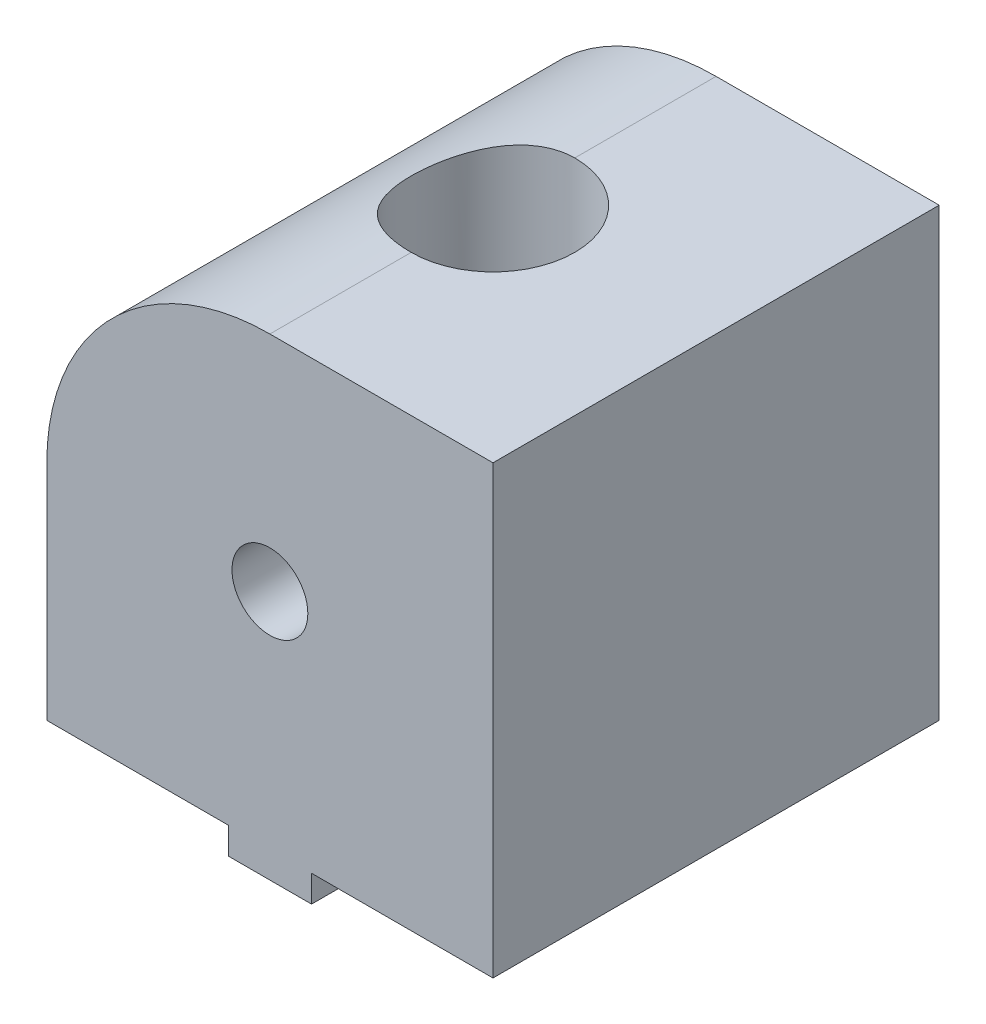
ISO-10303-21;
HEADER;
FILE_DESCRIPTION(('STEP AP214'),'2;1');
FILE_NAME('part.step','',(''),(''),'','','');
FILE_SCHEMA(('AUTOMOTIVE_DESIGN { 1 0 10303 214 1 1 1 1 }'));
ENDSEC;
DATA;
#1=APPLICATION_CONTEXT('core data for automotive mechanical design processes');
#2=APPLICATION_PROTOCOL_DEFINITION('international standard','automotive_design',2000,#1);
#3=PRODUCT_CONTEXT('',#1,'mechanical');
#4=PRODUCT('Part','Part','',(#3));
#5=PRODUCT_RELATED_PRODUCT_CATEGORY('part','',(#4));
#6=PRODUCT_DEFINITION_FORMATION('','',#4);
#7=PRODUCT_DEFINITION_CONTEXT('part definition',#1,'design');
#8=PRODUCT_DEFINITION('design','',#6,#7);
#9=PRODUCT_DEFINITION_SHAPE('','',#8);
#10=(LENGTH_UNIT() NAMED_UNIT(*) SI_UNIT(.MILLI.,.METRE.));
#11=(NAMED_UNIT(*) PLANE_ANGLE_UNIT() SI_UNIT($,.RADIAN.));
#12=(NAMED_UNIT(*) SI_UNIT($,.STERADIAN.) SOLID_ANGLE_UNIT());
#13=UNCERTAINTY_MEASURE_WITH_UNIT(LENGTH_MEASURE(1.E-05),#10,'distance_accuracy_value','');
#14=(GEOMETRIC_REPRESENTATION_CONTEXT(3) GLOBAL_UNCERTAINTY_ASSIGNED_CONTEXT((#13)) GLOBAL_UNIT_ASSIGNED_CONTEXT((#10,
#11,#12)) REPRESENTATION_CONTEXT('',''));
#15=CARTESIAN_POINT('',(0.,0.,0.));
#16=DIRECTION('',(0.,0.,1.));
#17=DIRECTION('',(1.,0.,0.));
#18=AXIS2_PLACEMENT_3D('',#15,#16,#17);
#19=CARTESIAN_POINT('',(-15.,-7.5,30.));
#20=DIRECTION('',(0.,1.,0.));
#21=DIRECTION('',(0.,0.,1.));
#22=AXIS2_PLACEMENT_3D('',#19,#20,#21);
#23=PLANE('',#22);
#24=CARTESIAN_POINT('',(0.,-7.5,15.));
#25=DIRECTION('',(0.,-1.,0.));
#26=DIRECTION('',(0.,0.,-1.));
#27=AXIS2_PLACEMENT_3D('',#24,#25,#26);
#28=CIRCLE('',#27,3.125);
#29=CARTESIAN_POINT('',(0.,-7.5,11.875));
#30=VERTEX_POINT('',#29);
#31=EDGE_CURVE('E185',#30,#30,#28,.T.);
#32=ORIENTED_EDGE('',*,*,#31,.F.);
#33=EDGE_LOOP('',(#32));
#34=FACE_BOUND('',#33,.T.);
#35=DIRECTION('',(0.,0.,-1.));
#36=VECTOR('',#35,1.);
#37=CARTESIAN_POINT('',(-2.8,-7.5,5.2));
#38=LINE('',#37,#36);
#39=CARTESIAN_POINT('',(-2.8,-7.5,5.2));
#40=VERTEX_POINT('',#39);
#41=CARTESIAN_POINT('',(-2.8,-7.5,0.));
#42=VERTEX_POINT('',#41);
#43=EDGE_CURVE('E36',#40,#42,#38,.T.);
#44=ORIENTED_EDGE('',*,*,#43,.F.);
#45=DIRECTION('',(-1.,0.,0.));
#46=VECTOR('',#45,1.);
#47=CARTESIAN_POINT('',(-2.8,-7.5,5.2));
#48=LINE('',#47,#46);
#49=CARTESIAN_POINT('',(2.8,-7.5,5.2));
#50=VERTEX_POINT('',#49);
#51=EDGE_CURVE('E40',#50,#40,#48,.T.);
#52=ORIENTED_EDGE('',*,*,#51,.F.);
#53=DIRECTION('',(0.,0.,1.));
#54=VECTOR('',#53,1.);
#55=CARTESIAN_POINT('',(2.8,-7.5,5.2));
#56=LINE('',#55,#54);
#57=CARTESIAN_POINT('',(2.8,-7.5,0.));
#58=VERTEX_POINT('',#57);
#59=EDGE_CURVE('E340',#58,#50,#56,.T.);
#60=ORIENTED_EDGE('',*,*,#59,.F.);
#61=DIRECTION('',(1.,0.,0.));
#62=VECTOR('',#61,1.);
#63=CARTESIAN_POINT('',(-15.,-7.5,0.));
#64=LINE('',#63,#62);
#65=CARTESIAN_POINT('',(15.,-7.5,0.));
#66=VERTEX_POINT('',#65);
#67=EDGE_CURVE('E218',#58,#66,#64,.T.);
#68=ORIENTED_EDGE('',*,*,#67,.T.);
#69=DIRECTION('',(0.,0.,-1.));
#70=VECTOR('',#69,1.);
#71=CARTESIAN_POINT('',(15.,-7.5,30.));
#72=LINE('',#71,#70);
#73=CARTESIAN_POINT('',(15.,-7.5,30.));
#74=VERTEX_POINT('',#73);
#75=EDGE_CURVE('E211',#74,#66,#72,.T.);
#76=ORIENTED_EDGE('',*,*,#75,.F.);
#77=DIRECTION('',(1.,0.,0.));
#78=VECTOR('',#77,1.);
#79=CARTESIAN_POINT('',(-15.,-7.5,30.));
#80=LINE('',#79,#78);
#81=CARTESIAN_POINT('',(2.8,-7.5,30.));
#82=VERTEX_POINT('',#81);
#83=EDGE_CURVE('E207',#82,#74,#80,.T.);
#84=ORIENTED_EDGE('',*,*,#83,.F.);
#85=DIRECTION('',(0.,0.,1.));
#86=VECTOR('',#85,1.);
#87=CARTESIAN_POINT('',(2.8,-7.5,24.8));
#88=LINE('',#87,#86);
#89=CARTESIAN_POINT('',(2.8,-7.5,24.8));
#90=VERTEX_POINT('',#89);
#91=EDGE_CURVE('E157',#90,#82,#88,.T.);
#92=ORIENTED_EDGE('',*,*,#91,.F.);
#93=DIRECTION('',(1.,0.,0.));
#94=VECTOR('',#93,1.);
#95=CARTESIAN_POINT('',(-2.80000000000001,-7.5,24.8));
#96=LINE('',#95,#94);
#97=CARTESIAN_POINT('',(-2.80000000000001,-7.5,24.8));
#98=VERTEX_POINT('',#97);
#99=EDGE_CURVE('E147',#98,#90,#96,.T.);
#100=ORIENTED_EDGE('',*,*,#99,.F.);
#101=DIRECTION('',(0.,0.,-1.));
#102=VECTOR('',#101,1.);
#103=CARTESIAN_POINT('',(-2.80000000000001,-7.5,24.8));
#104=LINE('',#103,#102);
#105=CARTESIAN_POINT('',(-2.80000000000001,-7.5,30.));
#106=VERTEX_POINT('',#105);
#107=EDGE_CURVE('E144',#106,#98,#104,.T.);
#108=ORIENTED_EDGE('',*,*,#107,.F.);
#109=CARTESIAN_POINT('',(-15.,-7.5,30.));
#110=VERTEX_POINT('',#109);
#111=EDGE_CURVE('E208',#110,#106,#80,.T.);
#112=ORIENTED_EDGE('',*,*,#111,.F.);
#113=DIRECTION('',(0.,0.,-1.));
#114=VECTOR('',#113,1.);
#115=CARTESIAN_POINT('',(-15.,-7.5,30.));
#116=LINE('',#115,#114);
#117=CARTESIAN_POINT('',(-15.,-7.5,0.));
#118=VERTEX_POINT('',#117);
#119=EDGE_CURVE('E224',#110,#118,#116,.T.);
#120=ORIENTED_EDGE('',*,*,#119,.T.);
#121=EDGE_CURVE('E219',#118,#42,#64,.T.);
#122=ORIENTED_EDGE('',*,*,#121,.T.);
#123=EDGE_LOOP('',(#44,#52,#60,#68,#76,#84,#92,#100,#108,#112,#120,#122));
#124=FACE_BOUND('',#123,.T.);
#125=ADVANCED_FACE('F16',(#34,#124),#23,.F.);
#126=CARTESIAN_POINT('',(0.,22.5,15.));
#127=DIRECTION('',(0.,-1.,0.));
#128=DIRECTION('',(0.,0.,-1.));
#129=AXIS2_PLACEMENT_3D('',#126,#127,#128);
#130=CYLINDRICAL_SURFACE('',#129,3.125);
#131=CARTESIAN_POINT('',(2.54999999999999,7.5,13.19358781005));
#132=CARTESIAN_POINT('',(2.55000412070554,7.59322262162485,13.1935986289894));
#133=CARTESIAN_POINT('',(2.54484060052404,7.68642800031268,13.1862408887736));
#134=CARTESIAN_POINT('',(2.52472718553897,7.86988365000782,13.158354567834));
#135=CARTESIAN_POINT('',(2.5097502438705,7.96012502795711,13.1377895896359));
#136=CARTESIAN_POINT('',(2.4640249934807,8.16800043304006,13.0774808183438));
#137=CARTESIAN_POINT('',(2.42950388737762,8.28351727652456,13.0334666239427));
#138=CARTESIAN_POINT('',(2.34662727946321,8.50493777388649,12.9352716504817));
#139=CARTESIAN_POINT('',(2.29823008201899,8.61081116782937,12.8810604022087));
#140=CARTESIAN_POINT('',(2.2052931062114,8.78282433958512,12.7851978103527));
#141=CARTESIAN_POINT('',(2.1639535014449,8.8513540361703,12.7446588173499));
#142=CARTESIAN_POINT('',(2.0752820213781,8.98393822192376,12.6628056964393));
#143=CARTESIAN_POINT('',(2.02794782091341,9.04799095954216,12.6214912730853));
#144=CARTESIAN_POINT('',(1.87715385264367,9.2332440750349,12.4982607377528));
#145=CARTESIAN_POINT('',(1.7647555498636,9.34781063367914,12.4168967366324));
#146=CARTESIAN_POINT('',(1.54209112137854,9.53495540580967,12.2795080085056));
#147=CARTESIAN_POINT('',(1.43608862067464,9.61132913034136,12.221703905306));
#148=CARTESIAN_POINT('',(1.20997799291758,9.74852541657173,12.1160675836106));
#149=CARTESIAN_POINT('',(1.08989290632597,9.80937287661068,12.0682194225323));
#150=CARTESIAN_POINT('',(0.858619932908675,9.90378051220216,11.9932383518777));
#151=CARTESIAN_POINT('',(0.749295132422135,9.94020065948708,11.963980453033));
#152=CARTESIAN_POINT('',(0.52434591761927,9.99820379007731,11.9171684692446));
#153=CARTESIAN_POINT('',(0.408725042556737,10.0197950182057,11.8996078808043));
#154=CARTESIAN_POINT('',(0.173896446058643,10.0468165068925,11.8776071847474));
#155=CARTESIAN_POINT('',(0.0546768198781908,10.0521853794981,11.8732169161471));
#156=CARTESIAN_POINT('',(-0.183056268288832,10.046198552428,11.878101725567));
#157=CARTESIAN_POINT('',(-0.301569728450937,10.0348428095611,11.8873768388782));
#158=CARTESIAN_POINT('',(-0.527107081530789,9.99738759215628,11.9177993571704));
#159=CARTESIAN_POINT('',(-0.634392563746823,9.97222020619044,11.9381957260784));
#160=CARTESIAN_POINT('',(-0.842682244446059,9.90919864665372,11.9888519426968));
#161=CARTESIAN_POINT('',(-0.943684794232299,9.871341159599,12.019114366454));
#162=CARTESIAN_POINT('',(-1.14673094614416,9.78056794153003,12.0908303045021));
#163=CARTESIAN_POINT('',(-1.24802200671678,9.72659031906572,12.1330551443083));
#164=CARTESIAN_POINT('',(-1.44019383435519,9.60740271378117,12.2246053046252));
#165=CARTESIAN_POINT('',(-1.53106964054239,9.54218741507388,12.2739339837243));
#166=CARTESIAN_POINT('',(-1.71974255300025,9.38753899948724,12.3879816277882));
#167=CARTESIAN_POINT('',(-1.81506966540772,9.29588800331457,12.4537712579224));
#168=CARTESIAN_POINT('',(-1.9899057801528,9.10001569724137,12.5879365101328));
#169=CARTESIAN_POINT('',(-2.06939175712052,8.99577643819195,12.6563157270048));
#170=CARTESIAN_POINT('',(-2.20877271982598,8.78043406733833,12.7873884768179));
#171=CARTESIAN_POINT('',(-2.26941362931763,8.66988482788536,12.8501981421513));
#172=CARTESIAN_POINT('',(-2.37490684017677,8.4373141614467,12.9673638661858));
#173=CARTESIAN_POINT('',(-2.41979366930185,8.31531857484245,13.021738264298));
#174=CARTESIAN_POINT('',(-2.47904326241211,8.10366051816675,13.0969914939581));
#175=CARTESIAN_POINT('',(-2.49859463156327,8.01730390878711,13.122958958652));
#176=CARTESIAN_POINT('',(-2.52873719186485,7.84056257000427,13.1637628827869));
#177=CARTESIAN_POINT('',(-2.53935042619249,7.75018833240068,13.1786267156423));
#178=CARTESIAN_POINT('',(-2.55078707851558,7.56682956298012,13.1946667207039));
#179=CARTESIAN_POINT('',(-2.55153418203648,7.47383025309954,13.1957361921135));
#180=CARTESIAN_POINT('',(-2.54295712961026,7.28919224946572,13.1836757009588));
#181=CARTESIAN_POINT('',(-2.53362092284318,7.19755531674822,13.1705287479621));
#182=CARTESIAN_POINT('',(-2.50279759318894,6.99941151501406,13.128524764032));
#183=CARTESIAN_POINT('',(-2.47916272440853,6.89384558183368,13.0969387668831));
#184=CARTESIAN_POINT('',(-2.42028805752767,6.69003915920124,13.0226125599949));
#185=CARTESIAN_POINT('',(-2.38501196014852,6.59182277721762,12.9798375486797));
#186=CARTESIAN_POINT('',(-2.31384546064502,6.42541531555942,12.8990653696066));
#187=CARTESIAN_POINT('',(-2.28010200806603,6.35564404958659,12.8623563201452));
#188=CARTESIAN_POINT('',(-2.20695459332342,6.2202431102021,12.7869169517358));
#189=CARTESIAN_POINT('',(-2.16754791249106,6.15461544785851,12.7481856677196));
#190=CARTESIAN_POINT('',(-2.08321426910233,6.02740285024823,12.6699456222344));
#191=CARTESIAN_POINT('',(-2.03828290681397,5.96582119779796,12.6304362624273));
#192=CARTESIAN_POINT('',(-1.94300323898292,5.84680360720131,12.5516948474693));
#193=CARTESIAN_POINT('',(-1.89265215189477,5.78936982335932,12.5124629458305));
#194=CARTESIAN_POINT('',(-1.73087655482973,5.62085845526139,12.394679761746));
#195=CARTESIAN_POINT('',(-1.61067403185151,5.51653100054359,12.3179390085894));
#196=CARTESIAN_POINT('',(-1.41411920646059,5.37650752520901,12.2122691465591));
#197=CARTESIAN_POINT('',(-1.34595247760745,5.33260575678327,12.1786421765912));
#198=CARTESIAN_POINT('',(-1.20436317648143,5.25084694177371,12.1153618478403));
#199=CARTESIAN_POINT('',(-1.13094325825553,5.21298687356642,12.0857065039365));
#200=CARTESIAN_POINT('',(-0.951154703543163,5.13128494292767,12.0212261271583));
#201=CARTESIAN_POINT('',(-0.842631386209389,5.09039754676108,11.9885364682058));
#202=CARTESIAN_POINT('',(-0.618434590701757,5.02336809146073,11.9346398352064));
#203=CARTESIAN_POINT('',(-0.502766686902108,4.99721469381713,11.9134240319887));
#204=CARTESIAN_POINT('',(-0.266664286878471,4.96116094958963,11.8841187021648));
#205=CARTESIAN_POINT('',(-0.146209685058561,4.95133872841502,11.8760922732764));
#206=CARTESIAN_POINT('',(0.094985702922554,4.94891852269161,11.8741176418441));
#207=CARTESIAN_POINT('',(0.215726455854043,4.95631862752204,11.8801678776547));
#208=CARTESIAN_POINT('',(0.444761322350213,4.98662398742941,11.9048238046639));
#209=CARTESIAN_POINT('',(0.553319753983,5.00835519171056,11.9224784860387));
#210=CARTESIAN_POINT('',(0.764690078049043,5.06489637860837,11.9680739047245));
#211=CARTESIAN_POINT('',(0.867500063381335,5.09971067243254,11.996018032606));
#212=CARTESIAN_POINT('',(1.07269117983065,5.18375264127882,12.0627518823807));
#213=CARTESIAN_POINT('',(1.17451054883058,5.23383631565378,12.1021766908112));
#214=CARTESIAN_POINT('',(1.36824490084621,5.34525939589473,12.1884542789509));
#215=CARTESIAN_POINT('',(1.46015978498987,5.40659891410625,12.2353071327995));
#216=CARTESIAN_POINT('',(1.65071234450904,5.55199791473754,12.3438663887282));
#217=CARTESIAN_POINT('',(1.74711164110931,5.63815291735244,12.4066811593248));
#218=CARTESIAN_POINT('',(1.92511668999991,5.82281622949751,12.5359243439246));
#219=CARTESIAN_POINT('',(2.00667532611319,5.92136225950853,12.6023634256202));
#220=CARTESIAN_POINT('',(2.12565211693667,6.08926328630154,12.7085171186501));
#221=CARTESIAN_POINT('',(2.16789308645159,6.15504603853533,12.7485657831647));
#222=CARTESIAN_POINT('',(2.24655565426944,6.29100754007445,12.8270537721244));
#223=CARTESIAN_POINT('',(2.28297394555679,6.36118875623349,12.8654921729323));
#224=CARTESIAN_POINT('',(2.34955542766315,6.50581530063573,12.9390136202424));
#225=CARTESIAN_POINT('',(2.37973953947154,6.58024526067606,12.9741076690412));
#226=CARTESIAN_POINT('',(2.43346373827902,6.73361292551419,13.0389669219641));
#227=CARTESIAN_POINT('',(2.45701217332771,6.81254481487366,13.0687388042638));
#228=CARTESIAN_POINT('',(2.50048007431247,6.9901622504071,13.1252381952768));
#229=CARTESIAN_POINT('',(2.51888657345377,7.08977296683471,13.1503429011096));
#230=CARTESIAN_POINT('',(2.54361871601011,7.29294194138274,13.1844777341903));
#231=CARTESIAN_POINT('',(2.54999542419178,7.39648160168137,13.1935757962355));
#232=CARTESIAN_POINT('',(2.54999999999999,7.5,13.19358781005));
#233=B_SPLINE_CURVE_WITH_KNOTS('',3,(#131,#132,#133,#134,#135,#136,#137,#138,#139,#140,#141,
#142,#143,#144,#145,#146,#147,#148,#149,#150,#151,#152,#153,#154,#155,#156,#157,#158,#159,#160,
#161,#162,#163,#164,#165,#166,#167,#168,#169,#170,#171,#172,#173,#174,#175,#176,#177,#178,#179,
#180,#181,#182,#183,#184,#185,#186,#187,#188,#189,#190,#191,#192,#193,#194,#195,#196,#197,#198,
#199,#200,#201,#202,#203,#204,#205,#206,#207,#208,#209,#210,#211,#212,#213,#214,#215,#216,#217,
#218,#219,#220,#221,#222,#223,#224,#225,#226,#227,#228,#229,#230,#231,#232),.UNSPECIFIED.,.T.,
.F.,(4,2,2,2,2,2,2,2,2,2,2,2,2,2,2,2,2,2,2,2,2,2,2,2,2,2,2,2,2,2,2,2,2,2,2,2,2,2,2,2,2,2,2,2,2,
2,2,2,2,2,4),(0.,0.279255640537843,0.559284196065706,0.942196773359687,1.3262722273161,
1.59509985772802,1.86403208133467,2.40086480375792,2.8279258875674,3.25429775850063,
3.6094673613963,3.96443933112241,4.3207528990001,4.67706738705791,5.01185739322485,
5.34673488384078,5.71229547401164,6.07802946661607,6.51957472875146,6.96175717752737,
7.38313034437948,7.80357414682048,8.07945062868439,8.35464473641442,8.63196623346102,
8.90961953159506,9.24584279314037,9.58312452015851,9.84008349272127,10.0971662347021,
10.3544550539936,10.6118765560351,11.1386473262692,11.4016189040546,11.66445854739,
12.0243659770232,12.3839960611806,12.7453416525385,13.1066471586326,13.4415176853109,
13.7764986571609,14.1355524262583,14.4946097792967,14.9243483715976,15.3554283604415,
15.6186778426527,15.8820763114775,16.1445759525105,16.4067438648499,16.718166253143,
17.0282636965109),.UNSPECIFIED.);
#234=CARTESIAN_POINT('',(2.54999999999999,7.5,13.19358781005));
#235=VERTEX_POINT('',#234);
#236=EDGE_CURVE('E196',#235,#235,#233,.T.);
#237=ORIENTED_EDGE('',*,*,#236,.F.);
#238=EDGE_LOOP('',(#237));
#239=FACE_BOUND('',#238,.T.);
#240=ORIENTED_EDGE('',*,*,#31,.T.);
#241=EDGE_LOOP('',(#240));
#242=FACE_BOUND('',#241,.T.);
#243=CARTESIAN_POINT('',(2.54999999999999,7.5,16.80641218995));
#244=CARTESIAN_POINT('',(2.55000412070554,7.40677737837515,16.8064013710106));
#245=CARTESIAN_POINT('',(2.54484060052404,7.31357199968732,16.8137591112264));
#246=CARTESIAN_POINT('',(2.52472718553897,7.13011634999218,16.841645432166));
#247=CARTESIAN_POINT('',(2.5097502438705,7.03987497204289,16.8622104103641));
#248=CARTESIAN_POINT('',(2.4640249934807,6.83199956695994,16.9225191816562));
#249=CARTESIAN_POINT('',(2.42950388737762,6.71648272347544,16.9665333760573));
#250=CARTESIAN_POINT('',(2.34662727946321,6.49506222611351,17.0647283495183));
#251=CARTESIAN_POINT('',(2.29823008201899,6.38918883217063,17.1189395977913));
#252=CARTESIAN_POINT('',(2.2052931062114,6.21717566041488,17.2148021896473));
#253=CARTESIAN_POINT('',(2.1639535014449,6.1486459638297,17.2553411826501));
#254=CARTESIAN_POINT('',(2.0752820213781,6.01606177807624,17.3371943035607));
#255=CARTESIAN_POINT('',(2.02794782091341,5.95200904045784,17.3785087269147));
#256=CARTESIAN_POINT('',(1.87715385264367,5.76675592496511,17.5017392622472));
#257=CARTESIAN_POINT('',(1.7647555498636,5.65218936632087,17.5831032633676));
#258=CARTESIAN_POINT('',(1.54209112137854,5.46504459419034,17.7204919914944));
#259=CARTESIAN_POINT('',(1.43608862067464,5.38867086965864,17.778296094694));
#260=CARTESIAN_POINT('',(1.20997799291758,5.25147458342827,17.8839324163894));
#261=CARTESIAN_POINT('',(1.08989290632597,5.19062712338932,17.9317805774677));
#262=CARTESIAN_POINT('',(0.858619932908677,5.09621948779784,18.0067616481223));
#263=CARTESIAN_POINT('',(0.749295132422136,5.05979934051292,18.036019546967));
#264=CARTESIAN_POINT('',(0.524345917619271,5.00179620992269,18.0828315307554));
#265=CARTESIAN_POINT('',(0.408725042556739,4.98020498179433,18.1003921191957));
#266=CARTESIAN_POINT('',(0.173896446058644,4.95318349310747,18.1223928152526));
#267=CARTESIAN_POINT('',(0.0546768198781918,4.94781462050186,18.1267830838529));
#268=CARTESIAN_POINT('',(-0.183056268288831,4.95380144757196,18.121898274433));
#269=CARTESIAN_POINT('',(-0.301569728450936,4.96515719043892,18.1126231611218));
#270=CARTESIAN_POINT('',(-0.527107081530786,5.00261240784372,18.0822006428296));
#271=CARTESIAN_POINT('',(-0.63439256374682,5.02777979380957,18.0618042739216));
#272=CARTESIAN_POINT('',(-0.842682244446056,5.09080135334628,18.0111480573032));
#273=CARTESIAN_POINT('',(-0.943684794232297,5.128658840401,17.980885633546));
#274=CARTESIAN_POINT('',(-1.14673094614416,5.21943205846997,17.9091696954979));
#275=CARTESIAN_POINT('',(-1.24802200671677,5.27340968093428,17.8669448556917));
#276=CARTESIAN_POINT('',(-1.44019383435519,5.39259728621883,17.7753946953748));
#277=CARTESIAN_POINT('',(-1.53106964054239,5.45781258492612,17.7260660162757));
#278=CARTESIAN_POINT('',(-1.71974255300025,5.61246100051276,17.6120183722118));
#279=CARTESIAN_POINT('',(-1.81506966540772,5.70411199668543,17.5462287420776));
#280=CARTESIAN_POINT('',(-1.9899057801528,5.89998430275863,17.4120634898672));
#281=CARTESIAN_POINT('',(-2.06939175712052,6.00422356180805,17.3436842729952));
#282=CARTESIAN_POINT('',(-2.20877271982598,6.21956593266168,17.2126115231821));
#283=CARTESIAN_POINT('',(-2.26941362931763,6.33011517211465,17.1498018578487));
#284=CARTESIAN_POINT('',(-2.37490684017677,6.5626858385533,17.0326361338142));
#285=CARTESIAN_POINT('',(-2.41979366930185,6.68468142515755,16.978261735702));
#286=CARTESIAN_POINT('',(-2.47904326241211,6.89633948183325,16.9030085060419));
#287=CARTESIAN_POINT('',(-2.49859463156327,6.98269609121288,16.877041041348));
#288=CARTESIAN_POINT('',(-2.52873719186485,7.15943742999573,16.8362371172131));
#289=CARTESIAN_POINT('',(-2.53935042619249,7.24981166759932,16.8213732843577));
#290=CARTESIAN_POINT('',(-2.55078707851558,7.43317043701988,16.8053332792961));
#291=CARTESIAN_POINT('',(-2.55153418203648,7.52616974690046,16.8042638078865));
#292=CARTESIAN_POINT('',(-2.54295712961026,7.71080775053429,16.8163242990412));
#293=CARTESIAN_POINT('',(-2.53362092284318,7.80244468325178,16.8294712520379));
#294=CARTESIAN_POINT('',(-2.50279759318894,8.00058848498595,16.871475235968));
#295=CARTESIAN_POINT('',(-2.47916272440853,8.10615441816632,16.9030612331169));
#296=CARTESIAN_POINT('',(-2.42028805752767,8.30996084079876,16.9773874400051));
#297=CARTESIAN_POINT('',(-2.38501196014852,8.40817722278238,17.0201624513203));
#298=CARTESIAN_POINT('',(-2.31384546064502,8.57458468444058,17.1009346303934));
#299=CARTESIAN_POINT('',(-2.28010200806603,8.64435595041341,17.1376436798548));
#300=CARTESIAN_POINT('',(-2.20695459332342,8.7797568897979,17.2130830482642));
#301=CARTESIAN_POINT('',(-2.16754791249106,8.84538455214149,17.2518143322804));
#302=CARTESIAN_POINT('',(-2.08321426910234,8.97259714975178,17.3300543777656));
#303=CARTESIAN_POINT('',(-2.03828290681398,9.03417880220204,17.3695637375727));
#304=CARTESIAN_POINT('',(-1.94300323898293,9.15319639279869,17.4483051525307));
#305=CARTESIAN_POINT('',(-1.89265215189478,9.21063017664068,17.4875370541695));
#306=CARTESIAN_POINT('',(-1.73087655482973,9.37914154473861,17.605320238254));
#307=CARTESIAN_POINT('',(-1.61067403185151,9.48346899945641,17.6820609914106));
#308=CARTESIAN_POINT('',(-1.4141192064606,9.623492474791,17.7877308534409));
#309=CARTESIAN_POINT('',(-1.34595247760746,9.66739424321673,17.8213578234088));
#310=CARTESIAN_POINT('',(-1.20436317648143,9.74915305822629,17.8846381521597));
#311=CARTESIAN_POINT('',(-1.13094325825553,9.78701312643358,17.9142934960635));
#312=CARTESIAN_POINT('',(-0.951154703543169,9.86871505707233,17.9787738728417));
#313=CARTESIAN_POINT('',(-0.842631386209396,9.90960245323892,18.0114635317942));
#314=CARTESIAN_POINT('',(-0.618434590701764,9.97663190853927,18.0653601647936));
#315=CARTESIAN_POINT('',(-0.502766686902114,10.0027853061829,18.0865759680113));
#316=CARTESIAN_POINT('',(-0.266664286878477,10.0388390504104,18.1158812978352));
#317=CARTESIAN_POINT('',(-0.146209685058567,10.048661271585,18.1239077267236));
#318=CARTESIAN_POINT('',(0.0949857029225484,10.0510814773084,18.1258823581559));
#319=CARTESIAN_POINT('',(0.215726455854038,10.043681372478,18.1198321223453));
#320=CARTESIAN_POINT('',(0.444761322350208,10.0133760125706,18.0951761953361));
#321=CARTESIAN_POINT('',(0.553319753982995,9.99164480828945,18.0775215139613));
#322=CARTESIAN_POINT('',(0.764690078049038,9.93510362139163,18.0319260952755));
#323=CARTESIAN_POINT('',(0.867500063381332,9.90028932756746,18.003981967394));
#324=CARTESIAN_POINT('',(1.07269117983064,9.81624735872119,17.9372481176193));
#325=CARTESIAN_POINT('',(1.17451054883058,9.76616368434623,17.8978233091888));
#326=CARTESIAN_POINT('',(1.36824490084621,9.65474060410527,17.8115457210491));
#327=CARTESIAN_POINT('',(1.46015978498987,9.59340108589375,17.7646928672005));
#328=CARTESIAN_POINT('',(1.65071234450904,9.44800208526246,17.6561336112718));
#329=CARTESIAN_POINT('',(1.74711164110931,9.36184708264757,17.5933188406752));
#330=CARTESIAN_POINT('',(1.92511668999991,9.1771837705025,17.4640756560754));
#331=CARTESIAN_POINT('',(2.00667532611319,9.07863774049147,17.3976365743798));
#332=CARTESIAN_POINT('',(2.12565211693667,8.91073671369847,17.2914828813499));
#333=CARTESIAN_POINT('',(2.16789308645159,8.84495396146468,17.2514342168353));
#334=CARTESIAN_POINT('',(2.24655565426944,8.70899245992556,17.1729462278756));
#335=CARTESIAN_POINT('',(2.28297394555679,8.63881124376652,17.1345078270677));
#336=CARTESIAN_POINT('',(2.34955542766315,8.49418469936428,17.0609863797576));
#337=CARTESIAN_POINT('',(2.37973953947153,8.41975473932395,17.0258923309588));
#338=CARTESIAN_POINT('',(2.43346373827901,8.26638707448582,16.9610330780359));
#339=CARTESIAN_POINT('',(2.45701217332771,8.18745518512635,16.9312611957362));
#340=CARTESIAN_POINT('',(2.50048007431247,8.00983774959291,16.8747618047232));
#341=CARTESIAN_POINT('',(2.51888657345377,7.9102270331653,16.8496570988904));
#342=CARTESIAN_POINT('',(2.54361871601011,7.70705805861727,16.8155222658097));
#343=CARTESIAN_POINT('',(2.54999542419178,7.60351839831863,16.8064242037645));
#344=CARTESIAN_POINT('',(2.54999999999999,7.5,16.80641218995));
#345=B_SPLINE_CURVE_WITH_KNOTS('',3,(#243,#244,#245,#246,#247,#248,#249,#250,#251,#252,#253,
#254,#255,#256,#257,#258,#259,#260,#261,#262,#263,#264,#265,#266,#267,#268,#269,#270,#271,#272,
#273,#274,#275,#276,#277,#278,#279,#280,#281,#282,#283,#284,#285,#286,#287,#288,#289,#290,#291,
#292,#293,#294,#295,#296,#297,#298,#299,#300,#301,#302,#303,#304,#305,#306,#307,#308,#309,#310,
#311,#312,#313,#314,#315,#316,#317,#318,#319,#320,#321,#322,#323,#324,#325,#326,#327,#328,#329,
#330,#331,#332,#333,#334,#335,#336,#337,#338,#339,#340,#341,#342,#343,#344),.UNSPECIFIED.,.T.,
.F.,(4,2,2,2,2,2,2,2,2,2,2,2,2,2,2,2,2,2,2,2,2,2,2,2,2,2,2,2,2,2,2,2,2,2,2,2,2,2,2,2,2,2,2,2,2,
2,2,2,2,2,4),(0.,0.279255640537843,0.559284196065706,0.942196773359689,1.32627222731609,
1.59509985772802,1.86403208133467,2.40086480375791,2.82792588756739,3.25429775850063,
3.6094673613963,3.96443933112241,4.3207528990001,4.6770673870579,5.01185739322485,
5.34673488384078,5.71229547401163,6.07802946661607,6.51957472875146,6.96175717752737,
7.38313034437948,7.80357414682048,8.07945062868439,8.35464473641442,8.63196623346102,
8.90961953159506,9.24584279314037,9.58312452015851,9.84008349272126,10.0971662347021,
10.3544550539936,10.6118765560351,11.1386473262692,11.4016189040546,11.66445854739,
12.0243659770231,12.3839960611806,12.7453416525385,13.1066471586326,13.4415176853109,
13.7764986571609,14.1355524262583,14.4946097792967,14.9243483715976,15.3554283604415,
15.6186778426527,15.8820763114775,16.1445759525105,16.4067438648499,16.718166253143,
17.0282636965109),.UNSPECIFIED.);
#346=CARTESIAN_POINT('',(2.54999999999999,7.5,16.80641218995));
#347=VERTEX_POINT('',#346);
#348=EDGE_CURVE('E188',#347,#347,#345,.T.);
#349=ORIENTED_EDGE('',*,*,#348,.F.);
#350=EDGE_LOOP('',(#349));
#351=FACE_BOUND('',#350,.T.);
#352=CARTESIAN_POINT('',(0.,12.5,15.));
#353=DIRECTION('',(0.,1.,0.));
#354=DIRECTION('',(0.,0.,1.));
#355=AXIS2_PLACEMENT_3D('',#352,#353,#354);
#356=CIRCLE('',#355,3.125);
#357=CARTESIAN_POINT('',(0.,12.5,18.125));
#358=VERTEX_POINT('',#357);
#359=EDGE_CURVE('E183',#358,#358,#356,.F.);
#360=ORIENTED_EDGE('',*,*,#359,.F.);
#361=EDGE_LOOP('',(#360));
#362=FACE_BOUND('',#361,.T.);
#363=ADVANCED_FACE('F249',(#239,#242,#351,#362),#130,.F.);
#364=CARTESIAN_POINT('',(0.,7.5,0.));
#365=DIRECTION('',(0.,0.,1.));
#366=DIRECTION('',(1.,0.,0.));
#367=AXIS2_PLACEMENT_3D('',#364,#365,#366);
#368=CYLINDRICAL_SURFACE('',#367,2.55);
#369=ORIENTED_EDGE('',*,*,#236,.T.);
#370=EDGE_LOOP('',(#369));
#371=FACE_BOUND('',#370,.T.);
#372=CARTESIAN_POINT('',(0.,7.5,0.));
#373=DIRECTION('',(0.,0.,1.));
#374=DIRECTION('',(1.,0.,0.));
#375=AXIS2_PLACEMENT_3D('',#372,#373,#374);
#376=CIRCLE('',#375,2.55);
#377=CARTESIAN_POINT('',(2.54999999999999,7.5,0.));
#378=VERTEX_POINT('',#377);
#379=EDGE_CURVE('E189',#378,#378,#376,.T.);
#380=ORIENTED_EDGE('',*,*,#379,.F.);
#381=EDGE_LOOP('',(#380));
#382=FACE_BOUND('',#381,.T.);
#383=ADVANCED_FACE('F252',(#371,#382),#368,.F.);
#384=CARTESIAN_POINT('',(0.,22.5,30.));
#385=DIRECTION('',(0.,-1.,0.));
#386=DIRECTION('',(0.,0.,-1.));
#387=AXIS2_PLACEMENT_3D('',#384,#385,#386);
#388=PLANE('',#387);
#389=DIRECTION('',(0.,0.,-1.));
#390=VECTOR('',#389,1.);
#391=CARTESIAN_POINT('',(0.,22.5,30.));
#392=LINE('',#391,#390);
#393=CARTESIAN_POINT('',(0.,22.5,9.5));
#394=VERTEX_POINT('',#393);
#395=CARTESIAN_POINT('',(0.,22.5,0.));
#396=VERTEX_POINT('',#395);
#397=EDGE_CURVE('E230',#394,#396,#392,.T.);
#398=ORIENTED_EDGE('',*,*,#397,.F.);
#399=CARTESIAN_POINT('',(0.,22.5,15.));
#400=DIRECTION('',(0.,1.,0.));
#401=DIRECTION('',(0.,0.,1.));
#402=AXIS2_PLACEMENT_3D('',#399,#400,#401);
#403=CIRCLE('',#402,5.5);
#404=CARTESIAN_POINT('',(0.,22.5,20.5));
#405=VERTEX_POINT('',#404);
#406=EDGE_CURVE('E179',#405,#394,#403,.T.);
#407=ORIENTED_EDGE('',*,*,#406,.F.);
#408=CARTESIAN_POINT('',(0.,22.5,30.));
#409=VERTEX_POINT('',#408);
#410=EDGE_CURVE('E231',#409,#405,#392,.T.);
#411=ORIENTED_EDGE('',*,*,#410,.F.);
#412=DIRECTION('',(-1.,0.,0.));
#413=VECTOR('',#412,1.);
#414=CARTESIAN_POINT('',(0.,22.5,30.));
#415=LINE('',#414,#413);
#416=CARTESIAN_POINT('',(15.,22.5,30.));
#417=VERTEX_POINT('',#416);
#418=EDGE_CURVE('E200',#417,#409,#415,.T.);
#419=ORIENTED_EDGE('',*,*,#418,.F.);
#420=DIRECTION('',(0.,0.,-1.));
#421=VECTOR('',#420,1.);
#422=CARTESIAN_POINT('',(15.,22.5,30.));
#423=LINE('',#422,#421);
#424=CARTESIAN_POINT('',(15.,22.5,0.));
#425=VERTEX_POINT('',#424);
#426=EDGE_CURVE('E29',#417,#425,#423,.T.);
#427=ORIENTED_EDGE('',*,*,#426,.T.);
#428=DIRECTION('',(-1.,0.,0.));
#429=VECTOR('',#428,1.);
#430=CARTESIAN_POINT('',(0.,22.5,0.));
#431=LINE('',#430,#429);
#432=EDGE_CURVE('E192',#425,#396,#431,.T.);
#433=ORIENTED_EDGE('',*,*,#432,.T.);
#434=EDGE_LOOP('',(#398,#407,#411,#419,#427,#433));
#435=FACE_BOUND('',#434,.T.);
#436=ADVANCED_FACE('F18',(#435),#388,.F.);
#437=CARTESIAN_POINT('',(0.,7.5,30.));
#438=DIRECTION('',(0.,0.,-1.));
#439=DIRECTION('',(-1.,0.,0.));
#440=AXIS2_PLACEMENT_3D('',#437,#438,#439);
#441=CYLINDRICAL_SURFACE('',#440,15.);
#442=ORIENTED_EDGE('',*,*,#410,.T.);
#443=CARTESIAN_POINT('',(0.,22.5,20.5));
#444=CARTESIAN_POINT('',(-0.149400970342133,22.5000214707164,20.5000215646942));
#445=CARTESIAN_POINT('',(-0.2987930614423,22.4977687202103,20.4939135367879));
#446=CARTESIAN_POINT('',(-0.596419673633905,22.4888715426071,20.4695984094006));
#447=CARTESIAN_POINT('',(-0.74465448797706,22.4822282671925,20.4513944827989));
#448=CARTESIAN_POINT('',(-1.03845520577173,22.4647335106928,20.4031216241946));
#449=CARTESIAN_POINT('',(-1.18402789796902,22.4538949927858,20.3730892368287));
#450=CARTESIAN_POINT('',(-1.47194606960431,22.4283037597091,20.301450672856));
#451=CARTESIAN_POINT('',(-1.61429144235401,22.4135509153441,20.2598441142335));
#452=CARTESIAN_POINT('',(-1.89468234928417,22.3805274045782,20.1654665737194));
#453=CARTESIAN_POINT('',(-2.03273113747461,22.3622594795405,20.1127042888776));
#454=CARTESIAN_POINT('',(-2.30381721388162,22.3226583812607,19.9964177502488));
#455=CARTESIAN_POINT('',(-2.43685261127086,22.3013240658317,19.9328894847007));
#456=CARTESIAN_POINT('',(-2.69709581095935,22.2561212499647,19.7955519935697));
#457=CARTESIAN_POINT('',(-2.82430245808849,22.2322522502736,19.7217407416655));
#458=CARTESIAN_POINT('',(-3.07215409843515,22.1825705453838,19.5643671672142));
#459=CARTESIAN_POINT('',(-3.19279670139744,22.1567571401933,19.4808013269782));
#460=CARTESIAN_POINT('',(-3.55233528389177,22.075409499856,19.209869279588));
#461=CARTESIAN_POINT('',(-3.77946219138318,22.017659935853,19.0072058684958));
#462=CARTESIAN_POINT('',(-4.19733494080417,21.902414540142,18.5671394844752));
#463=CARTESIAN_POINT('',(-4.38806936190994,21.8449187935995,18.3297256472109));
#464=CARTESIAN_POINT('',(-4.64629569737498,21.7625561516036,17.9473399957));
#465=CARTESIAN_POINT('',(-4.72891674453882,21.7353053358172,17.8128815067113));
#466=CARTESIAN_POINT('',(-4.88246988493765,21.6833724494445,17.5370013968834));
#467=CARTESIAN_POINT('',(-4.9534067241894,21.6586893373893,17.3955826337106));
#468=CARTESIAN_POINT('',(-5.08300459041561,21.6126821879751,17.1066887847663));
#469=CARTESIAN_POINT('',(-5.14166446059102,21.5913584672018,16.9592131298481));
#470=CARTESIAN_POINT('',(-5.24612573515038,21.5528028251992,16.6593245390051));
#471=CARTESIAN_POINT('',(-5.29193325397515,21.535568958846,16.5069139894573));
#472=CARTESIAN_POINT('',(-5.36871102926306,21.5063758035898,16.2043038436556));
#473=CARTESIAN_POINT('',(-5.40019170579059,21.4942365164282,16.0542510769605));
#474=CARTESIAN_POINT('',(-5.45053103824887,21.4747072594277,15.7517987392933));
#475=CARTESIAN_POINT('',(-5.46939515752132,21.4673152339396,15.5994002133896));
#476=CARTESIAN_POINT('',(-5.49431221882969,21.4575324928707,15.2934158740218));
#477=CARTESIAN_POINT('',(-5.50036659610638,21.4551412169917,15.1398301955053));
#478=CARTESIAN_POINT('',(-5.49959910163711,21.455443776029,14.8326989358021));
#479=CARTESIAN_POINT('',(-5.49277769904013,21.4581374256681,14.6791533533582));
#480=CARTESIAN_POINT('',(-5.4670941340236,21.4682159112503,14.3820784782838));
#481=CARTESIAN_POINT('',(-5.44894151808852,21.475324184411,14.2384777472126));
#482=CARTESIAN_POINT('',(-5.40143081673732,21.4937555323064,13.9533684436324));
#483=CARTESIAN_POINT('',(-5.37206899942002,21.5050800107195,13.8118605842232));
#484=CARTESIAN_POINT('',(-5.30242380528447,21.5315960291376,13.5319761370937));
#485=CARTESIAN_POINT('',(-5.26214345618815,21.546786497028,13.393598692814));
#486=CARTESIAN_POINT('',(-5.17098989712055,21.5805974629771,13.1207552499791));
#487=CARTESIAN_POINT('',(-5.12011264148297,21.5992192707321,12.9862907677176));
#488=CARTESIAN_POINT('',(-5.00717045526588,21.6397279147485,12.7197432610212));
#489=CARTESIAN_POINT('',(-4.94492067141302,21.6616674767857,12.5877466379481));
#490=CARTESIAN_POINT('',(-4.81031394874372,21.7079535553432,12.329400077802));
#491=CARTESIAN_POINT('',(-4.73795357075614,21.7323008900529,12.2030520815234));
#492=CARTESIAN_POINT('',(-4.58362181605643,21.7827518422497,11.956722553968));
#493=CARTESIAN_POINT('',(-4.50164942806587,21.8088556444111,11.8367416945094));
#494=CARTESIAN_POINT('',(-4.32860267777688,21.8621514489669,11.6037882241934));
#495=CARTESIAN_POINT('',(-4.23752792307165,21.8893434982458,11.4908159158182));
#496=CARTESIAN_POINT('',(-4.04066924765884,21.945903886733,11.2654600442585));
#497=CARTESIAN_POINT('',(-3.9343164088647,21.9752998823112,11.1535797444713));
#498=CARTESIAN_POINT('',(-3.7125754088682,22.0337512143917,10.939142245398));
#499=CARTESIAN_POINT('',(-3.59719002093189,22.0628066523301,10.8365822052456));
#500=CARTESIAN_POINT('',(-3.3579596302989,22.1198233419477,10.6413351069273));
#501=CARTESIAN_POINT('',(-3.2341090933851,22.147783858653,10.54865461097));
#502=CARTESIAN_POINT('',(-2.97880972546284,22.2018266967768,10.3739206576114));
#503=CARTESIAN_POINT('',(-2.84736394769856,22.2279097635799,10.2918629722981));
#504=CARTESIAN_POINT('',(-2.57559168474284,22.2778787600085,10.1377891928784));
#505=CARTESIAN_POINT('',(-2.43516068636514,22.3017253307337,10.0659444219959));
#506=CARTESIAN_POINT('',(-2.14826291044756,22.3460777605301,9.93444417868659));
#507=CARTESIAN_POINT('',(-2.00179869925818,22.3665850220287,9.87478358651582));
#508=CARTESIAN_POINT('',(-1.70397841290446,22.4036554209647,9.76822766061058));
#509=CARTESIAN_POINT('',(-1.55262746525731,22.4202225491218,9.72131940386557));
#510=CARTESIAN_POINT('',(-1.24611036401874,22.4489432671106,9.64067953558075));
#511=CARTESIAN_POINT('',(-1.09094589846046,22.4610987734504,9.60694220181142));
#512=CARTESIAN_POINT('',(-0.780337617627967,22.4804827696389,9.5533943187323));
#513=CARTESIAN_POINT('',(-0.624933059711337,22.4877825730083,9.53338205302253));
#514=CARTESIAN_POINT('',(-0.313022135804024,22.4975511686564,9.50667999531904));
#515=CARTESIAN_POINT('',(-0.156517307868154,22.5000257218457,9.49997431629989));
#516=CARTESIAN_POINT('',(0.,22.5,9.5));
#517=B_SPLINE_CURVE_WITH_KNOTS('',3,(#443,#444,#445,#446,#447,#448,#449,#450,#451,#452,#453,
#454,#455,#456,#457,#458,#459,#460,#461,#462,#463,#464,#465,#466,#467,#468,#469,#470,#471,#472,
#473,#474,#475,#476,#477,#478,#479,#480,#481,#482,#483,#484,#485,#486,#487,#488,#489,#490,#491,
#492,#493,#494,#495,#496,#497,#498,#499,#500,#501,#502,#503,#504,#505,#506,#507,#508,#509,#510,
#511,#512,#513,#514,#515,#516),.UNSPECIFIED.,.F.,.F.,(4,2,2,2,2,2,2,2,2,2,2,2,2,2,2,2,2,2,2,2,2,
2,2,2,2,2,2,2,2,2,2,2,2,2,2,2,4),(0.,0.448047385436715,0.895977289779366,1.34253401282762,
1.78910547662925,2.23533006680179,2.68172130213997,3.1282006261748,3.57484145942544,
4.4999506747711,5.42534973549364,5.90529419894141,6.38504323006671,6.86483744527767,
7.3444030122848,7.80520418076153,8.26580567931194,8.72635556799674,9.18688867615689,
9.6211332999548,10.0555226239187,10.4897916142134,10.9242267037734,11.3664797377146,
11.8088835742177,12.2513339978088,12.6938035038548,13.164674708352,13.6354019039288,
14.1064398436696,14.5772897286477,15.0552864807075,15.5330819652717,16.0103914392835,
16.4874933103783,16.9574236707087,17.4267926325048),.UNSPECIFIED.);
#518=EDGE_CURVE('E10',#405,#394,#517,.T.);
#519=ORIENTED_EDGE('',*,*,#518,.T.);
#520=ORIENTED_EDGE('',*,*,#397,.T.);
#521=CARTESIAN_POINT('',(0.,7.5,0.));
#522=DIRECTION('',(0.,0.,1.));
#523=DIRECTION('',(-1.,0.,0.));
#524=AXIS2_PLACEMENT_3D('',#521,#522,#523);
#525=CIRCLE('',#524,15.);
#526=CARTESIAN_POINT('',(-15.,7.5,0.));
#527=VERTEX_POINT('',#526);
#528=EDGE_CURVE('E214',#396,#527,#525,.T.);
#529=ORIENTED_EDGE('',*,*,#528,.T.);
#530=DIRECTION('',(0.,0.,-1.));
#531=VECTOR('',#530,1.);
#532=CARTESIAN_POINT('',(-15.,7.5,30.));
#533=LINE('',#532,#531);
#534=CARTESIAN_POINT('',(-15.,7.5,30.));
#535=VERTEX_POINT('',#534);
#536=EDGE_CURVE('E227',#535,#527,#533,.T.);
#537=ORIENTED_EDGE('',*,*,#536,.F.);
#538=CARTESIAN_POINT('',(0.,7.5,30.));
#539=DIRECTION('',(0.,0.,1.));
#540=DIRECTION('',(-1.,0.,0.));
#541=AXIS2_PLACEMENT_3D('',#538,#539,#540);
#542=CIRCLE('',#541,15.);
#543=EDGE_CURVE('E203',#409,#535,#542,.T.);
#544=ORIENTED_EDGE('',*,*,#543,.F.);
#545=EDGE_LOOP('',(#442,#519,#520,#529,#537,#544));
#546=FACE_BOUND('',#545,.T.);
#547=ADVANCED_FACE('F306',(#546),#441,.T.);
#548=CARTESIAN_POINT('',(-15.,-7.5,30.));
#549=DIRECTION('',(1.,0.,0.));
#550=DIRECTION('',(0.,0.,-1.));
#551=AXIS2_PLACEMENT_3D('',#548,#549,#550);
#552=PLANE('',#551);
#553=DIRECTION('',(0.,-1.,0.));
#554=VECTOR('',#553,1.);
#555=CARTESIAN_POINT('',(-15.,-7.5,0.));
#556=LINE('',#555,#554);
#557=EDGE_CURVE('E216',#527,#118,#556,.T.);
#558=ORIENTED_EDGE('',*,*,#557,.T.);
#559=ORIENTED_EDGE('',*,*,#119,.F.);
#560=DIRECTION('',(0.,-1.,0.));
#561=VECTOR('',#560,1.);
#562=CARTESIAN_POINT('',(-15.,-7.5,30.));
#563=LINE('',#562,#561);
#564=EDGE_CURVE('E205',#535,#110,#563,.T.);
#565=ORIENTED_EDGE('',*,*,#564,.F.);
#566=ORIENTED_EDGE('',*,*,#536,.T.);
#567=EDGE_LOOP('',(#558,#559,#565,#566));
#568=FACE_BOUND('',#567,.T.);
#569=ADVANCED_FACE('F304',(#568),#552,.F.);
#570=CARTESIAN_POINT('',(15.,-7.5,30.));
#571=DIRECTION('',(-1.,0.,0.));
#572=DIRECTION('',(0.,-1.,0.));
#573=AXIS2_PLACEMENT_3D('',#570,#571,#572);
#574=PLANE('',#573);
#575=DIRECTION('',(0.,1.,0.));
#576=VECTOR('',#575,1.);
#577=CARTESIAN_POINT('',(15.,-7.5,0.));
#578=LINE('',#577,#576);
#579=EDGE_CURVE('E201',#66,#425,#578,.T.);
#580=ORIENTED_EDGE('',*,*,#579,.T.);
#581=ORIENTED_EDGE('',*,*,#426,.F.);
#582=DIRECTION('',(0.,1.,0.));
#583=VECTOR('',#582,1.);
#584=CARTESIAN_POINT('',(15.,22.5,30.));
#585=LINE('',#584,#583);
#586=EDGE_CURVE('E197',#74,#417,#585,.T.);
#587=ORIENTED_EDGE('',*,*,#586,.F.);
#588=ORIENTED_EDGE('',*,*,#75,.T.);
#589=EDGE_LOOP('',(#580,#581,#587,#588));
#590=FACE_BOUND('',#589,.T.);
#591=ADVANCED_FACE('F302',(#590),#574,.F.);
#592=CARTESIAN_POINT('',(0.,7.5,30.));
#593=DIRECTION('',(0.,0.,-1.));
#594=DIRECTION('',(-1.,0.,0.));
#595=AXIS2_PLACEMENT_3D('',#592,#593,#594);
#596=PLANE('',#595);
#597=CARTESIAN_POINT('',(0.,7.5,30.));
#598=DIRECTION('',(0.,0.,1.));
#599=DIRECTION('',(1.,0.,0.));
#600=AXIS2_PLACEMENT_3D('',#597,#598,#599);
#601=CIRCLE('',#600,2.55);
#602=CARTESIAN_POINT('',(2.54999999999999,7.5,30.));
#603=VERTEX_POINT('',#602);
#604=EDGE_CURVE('E193',#603,#603,#601,.T.);
#605=ORIENTED_EDGE('',*,*,#604,.F.);
#606=EDGE_LOOP('',(#605));
#607=FACE_BOUND('',#606,.T.);
#608=ORIENTED_EDGE('',*,*,#586,.T.);
#609=ORIENTED_EDGE('',*,*,#418,.T.);
#610=ORIENTED_EDGE('',*,*,#543,.T.);
#611=ORIENTED_EDGE('',*,*,#564,.T.);
#612=ORIENTED_EDGE('',*,*,#111,.T.);
#613=DIRECTION('',(0.,1.,0.));
#614=VECTOR('',#613,1.);
#615=CARTESIAN_POINT('',(-2.80000000000001,-9.3,30.));
#616=LINE('',#615,#614);
#617=CARTESIAN_POINT('',(-2.80000000000001,-9.3,30.));
#618=VERTEX_POINT('',#617);
#619=EDGE_CURVE('E162',#618,#106,#616,.T.);
#620=ORIENTED_EDGE('',*,*,#619,.F.);
#621=DIRECTION('',(-1.,0.,0.));
#622=VECTOR('',#621,1.);
#623=CARTESIAN_POINT('',(-2.80000000000001,-9.3,30.));
#624=LINE('',#623,#622);
#625=CARTESIAN_POINT('',(2.8,-9.3,30.));
#626=VERTEX_POINT('',#625);
#627=EDGE_CURVE('E161',#626,#618,#624,.T.);
#628=ORIENTED_EDGE('',*,*,#627,.F.);
#629=DIRECTION('',(0.,1.,0.));
#630=VECTOR('',#629,1.);
#631=CARTESIAN_POINT('',(2.8,-9.3,30.));
#632=LINE('',#631,#630);
#633=EDGE_CURVE('E170',#626,#82,#632,.T.);
#634=ORIENTED_EDGE('',*,*,#633,.T.);
#635=ORIENTED_EDGE('',*,*,#83,.T.);
#636=EDGE_LOOP('',(#608,#609,#610,#611,#612,#620,#628,#634,#635));
#637=FACE_BOUND('',#636,.T.);
#638=ADVANCED_FACE('F328',(#607,#637),#596,.F.);
#639=CARTESIAN_POINT('',(0.,7.5,0.));
#640=DIRECTION('',(0.,0.,-1.));
#641=DIRECTION('',(-1.,0.,0.));
#642=AXIS2_PLACEMENT_3D('',#639,#640,#641);
#643=PLANE('',#642);
#644=ORIENTED_EDGE('',*,*,#379,.T.);
#645=EDGE_LOOP('',(#644));
#646=FACE_BOUND('',#645,.T.);
#647=ORIENTED_EDGE('',*,*,#432,.F.);
#648=ORIENTED_EDGE('',*,*,#579,.F.);
#649=ORIENTED_EDGE('',*,*,#67,.F.);
#650=DIRECTION('',(0.,1.,0.));
#651=VECTOR('',#650,1.);
#652=CARTESIAN_POINT('',(2.8,-9.3,0.));
#653=LINE('',#652,#651);
#654=CARTESIAN_POINT('',(2.8,-9.3,0.));
#655=VERTEX_POINT('',#654);
#656=EDGE_CURVE('E129',#655,#58,#653,.T.);
#657=ORIENTED_EDGE('',*,*,#656,.F.);
#658=DIRECTION('',(1.,0.,0.));
#659=VECTOR('',#658,1.);
#660=CARTESIAN_POINT('',(-2.8,-9.3,0.));
#661=LINE('',#660,#659);
#662=CARTESIAN_POINT('',(-2.8,-9.3,0.));
#663=VERTEX_POINT('',#662);
#664=EDGE_CURVE('E121',#663,#655,#661,.T.);
#665=ORIENTED_EDGE('',*,*,#664,.F.);
#666=DIRECTION('',(0.,1.,0.));
#667=VECTOR('',#666,1.);
#668=CARTESIAN_POINT('',(-2.8,-9.3,0.));
#669=LINE('',#668,#667);
#670=EDGE_CURVE('E127',#663,#42,#669,.T.);
#671=ORIENTED_EDGE('',*,*,#670,.T.);
#672=ORIENTED_EDGE('',*,*,#121,.F.);
#673=ORIENTED_EDGE('',*,*,#557,.F.);
#674=ORIENTED_EDGE('',*,*,#528,.F.);
#675=EDGE_LOOP('',(#647,#648,#649,#657,#665,#671,#672,#673,#674));
#676=FACE_BOUND('',#675,.T.);
#677=ADVANCED_FACE('F124',(#646,#676),#643,.T.);
#678=ORIENTED_EDGE('',*,*,#348,.T.);
#679=EDGE_LOOP('',(#678));
#680=FACE_BOUND('',#679,.T.);
#681=ORIENTED_EDGE('',*,*,#604,.T.);
#682=EDGE_LOOP('',(#681));
#683=FACE_BOUND('',#682,.T.);
#684=ADVANCED_FACE('F246',(#680,#683),#368,.F.);
#685=CARTESIAN_POINT('',(0.,12.5,15.));
#686=DIRECTION('',(0.,1.,0.));
#687=DIRECTION('',(0.,0.,1.));
#688=AXIS2_PLACEMENT_3D('',#685,#686,#687);
#689=CYLINDRICAL_SURFACE('',#688,5.5);
#690=CARTESIAN_POINT('',(0.,12.5,15.));
#691=DIRECTION('',(0.,1.,0.));
#692=DIRECTION('',(0.,0.,1.));
#693=AXIS2_PLACEMENT_3D('',#690,#691,#692);
#694=CIRCLE('',#693,5.5);
#695=CARTESIAN_POINT('',(0.,12.5,20.5));
#696=VERTEX_POINT('',#695);
#697=EDGE_CURVE('E180',#696,#696,#694,.T.);
#698=ORIENTED_EDGE('',*,*,#697,.F.);
#699=EDGE_LOOP('',(#698));
#700=FACE_BOUND('',#699,.T.);
#701=ORIENTED_EDGE('',*,*,#406,.T.);
#702=ORIENTED_EDGE('',*,*,#518,.F.);
#703=EDGE_LOOP('',(#701,#702));
#704=FACE_BOUND('',#703,.T.);
#705=ADVANCED_FACE('F254',(#700,#704),#689,.F.);
#706=CARTESIAN_POINT('',(0.,12.5,15.));
#707=DIRECTION('',(0.,1.,0.));
#708=DIRECTION('',(0.,0.,1.));
#709=AXIS2_PLACEMENT_3D('',#706,#707,#708);
#710=PLANE('',#709);
#711=ORIENTED_EDGE('',*,*,#697,.T.);
#712=EDGE_LOOP('',(#711));
#713=FACE_BOUND('',#712,.T.);
#714=ORIENTED_EDGE('',*,*,#359,.T.);
#715=EDGE_LOOP('',(#714));
#716=FACE_BOUND('',#715,.T.);
#717=ADVANCED_FACE('F259',(#713,#716),#710,.T.);
#718=CARTESIAN_POINT('',(-2.80000000000001,-9.3,24.8));
#719=DIRECTION('',(1.,0.,0.));
#720=DIRECTION('',(0.,0.,-1.));
#721=AXIS2_PLACEMENT_3D('',#718,#719,#720);
#722=PLANE('',#721);
#723=ORIENTED_EDGE('',*,*,#107,.T.);
#724=DIRECTION('',(0.,1.,0.));
#725=VECTOR('',#724,1.);
#726=CARTESIAN_POINT('',(-2.80000000000001,-9.3,24.8));
#727=LINE('',#726,#725);
#728=CARTESIAN_POINT('',(-2.80000000000001,-9.3,24.8));
#729=VERTEX_POINT('',#728);
#730=EDGE_CURVE('E176',#729,#98,#727,.T.);
#731=ORIENTED_EDGE('',*,*,#730,.F.);
#732=DIRECTION('',(0.,0.,-1.));
#733=VECTOR('',#732,1.);
#734=CARTESIAN_POINT('',(-2.80000000000001,-9.3,24.8));
#735=LINE('',#734,#733);
#736=EDGE_CURVE('E153',#618,#729,#735,.T.);
#737=ORIENTED_EDGE('',*,*,#736,.F.);
#738=ORIENTED_EDGE('',*,*,#619,.T.);
#739=EDGE_LOOP('',(#723,#731,#737,#738));
#740=FACE_BOUND('',#739,.T.);
#741=ADVANCED_FACE('F263',(#740),#722,.F.);
#742=CARTESIAN_POINT('',(-2.80000000000001,-9.3,24.8));
#743=DIRECTION('',(0.,0.,1.));
#744=DIRECTION('',(1.,0.,0.));
#745=AXIS2_PLACEMENT_3D('',#742,#743,#744);
#746=PLANE('',#745);
#747=ORIENTED_EDGE('',*,*,#99,.T.);
#748=DIRECTION('',(0.,1.,0.));
#749=VECTOR('',#748,1.);
#750=CARTESIAN_POINT('',(2.8,-9.3,24.8));
#751=LINE('',#750,#749);
#752=CARTESIAN_POINT('',(2.8,-9.3,24.8));
#753=VERTEX_POINT('',#752);
#754=EDGE_CURVE('E173',#753,#90,#751,.T.);
#755=ORIENTED_EDGE('',*,*,#754,.F.);
#756=DIRECTION('',(1.,0.,0.));
#757=VECTOR('',#756,1.);
#758=CARTESIAN_POINT('',(-2.80000000000001,-9.3,24.8));
#759=LINE('',#758,#757);
#760=EDGE_CURVE('E156',#729,#753,#759,.T.);
#761=ORIENTED_EDGE('',*,*,#760,.F.);
#762=ORIENTED_EDGE('',*,*,#730,.T.);
#763=EDGE_LOOP('',(#747,#755,#761,#762));
#764=FACE_BOUND('',#763,.T.);
#765=ADVANCED_FACE('F267',(#764),#746,.F.);
#766=CARTESIAN_POINT('',(2.8,-9.3,24.8));
#767=DIRECTION('',(-1.,0.,0.));
#768=DIRECTION('',(0.,0.,1.));
#769=AXIS2_PLACEMENT_3D('',#766,#767,#768);
#770=PLANE('',#769);
#771=ORIENTED_EDGE('',*,*,#91,.T.);
#772=ORIENTED_EDGE('',*,*,#633,.F.);
#773=DIRECTION('',(0.,0.,1.));
#774=VECTOR('',#773,1.);
#775=CARTESIAN_POINT('',(2.8,-9.3,24.8));
#776=LINE('',#775,#774);
#777=EDGE_CURVE('E159',#753,#626,#776,.T.);
#778=ORIENTED_EDGE('',*,*,#777,.F.);
#779=ORIENTED_EDGE('',*,*,#754,.T.);
#780=EDGE_LOOP('',(#771,#772,#778,#779));
#781=FACE_BOUND('',#780,.T.);
#782=ADVANCED_FACE('F271',(#781),#770,.F.);
#783=CARTESIAN_POINT('',(0.,-9.3,0.));
#784=DIRECTION('',(0.,1.,0.));
#785=DIRECTION('',(0.,0.,1.));
#786=AXIS2_PLACEMENT_3D('',#783,#784,#785);
#787=PLANE('',#786);
#788=ORIENTED_EDGE('',*,*,#736,.T.);
#789=ORIENTED_EDGE('',*,*,#760,.T.);
#790=ORIENTED_EDGE('',*,*,#777,.T.);
#791=ORIENTED_EDGE('',*,*,#627,.T.);
#792=EDGE_LOOP('',(#788,#789,#790,#791));
#793=FACE_BOUND('',#792,.T.);
#794=ADVANCED_FACE('F275',(#793),#787,.F.);
#795=CARTESIAN_POINT('',(-2.8,-9.3,5.2));
#796=DIRECTION('',(1.,0.,0.));
#797=DIRECTION('',(0.,0.,-1.));
#798=AXIS2_PLACEMENT_3D('',#795,#796,#797);
#799=PLANE('',#798);
#800=ORIENTED_EDGE('',*,*,#43,.T.);
#801=ORIENTED_EDGE('',*,*,#670,.F.);
#802=DIRECTION('',(0.,0.,-1.));
#803=VECTOR('',#802,1.);
#804=CARTESIAN_POINT('',(-2.8,-9.3,5.2));
#805=LINE('',#804,#803);
#806=CARTESIAN_POINT('',(-2.8,-9.3,5.2));
#807=VERTEX_POINT('',#806);
#808=EDGE_CURVE('E133',#807,#663,#805,.T.);
#809=ORIENTED_EDGE('',*,*,#808,.F.);
#810=DIRECTION('',(0.,1.,0.));
#811=VECTOR('',#810,1.);
#812=CARTESIAN_POINT('',(-2.8,-9.3,5.2));
#813=LINE('',#812,#811);
#814=EDGE_CURVE('E345',#807,#40,#813,.T.);
#815=ORIENTED_EDGE('',*,*,#814,.T.);
#816=EDGE_LOOP('',(#800,#801,#809,#815));
#817=FACE_BOUND('',#816,.T.);
#818=ADVANCED_FACE('F143',(#817),#799,.F.);
#819=CARTESIAN_POINT('',(2.8,-9.3,5.2));
#820=DIRECTION('',(-1.,0.,0.));
#821=DIRECTION('',(0.,0.,1.));
#822=AXIS2_PLACEMENT_3D('',#819,#820,#821);
#823=PLANE('',#822);
#824=ORIENTED_EDGE('',*,*,#59,.T.);
#825=DIRECTION('',(0.,1.,0.));
#826=VECTOR('',#825,1.);
#827=CARTESIAN_POINT('',(2.8,-9.3,5.2));
#828=LINE('',#827,#826);
#829=CARTESIAN_POINT('',(2.8,-9.3,5.2));
#830=VERTEX_POINT('',#829);
#831=EDGE_CURVE('E149',#830,#50,#828,.T.);
#832=ORIENTED_EDGE('',*,*,#831,.F.);
#833=DIRECTION('',(0.,0.,1.));
#834=VECTOR('',#833,1.);
#835=CARTESIAN_POINT('',(2.8,-9.3,5.2));
#836=LINE('',#835,#834);
#837=EDGE_CURVE('E132',#655,#830,#836,.T.);
#838=ORIENTED_EDGE('',*,*,#837,.F.);
#839=ORIENTED_EDGE('',*,*,#656,.T.);
#840=EDGE_LOOP('',(#824,#832,#838,#839));
#841=FACE_BOUND('',#840,.T.);
#842=ADVANCED_FACE('F282',(#841),#823,.F.);
#843=CARTESIAN_POINT('',(-2.8,-9.3,5.2));
#844=DIRECTION('',(0.,0.,-1.));
#845=DIRECTION('',(-1.,0.,0.));
#846=AXIS2_PLACEMENT_3D('',#843,#844,#845);
#847=PLANE('',#846);
#848=ORIENTED_EDGE('',*,*,#51,.T.);
#849=ORIENTED_EDGE('',*,*,#814,.F.);
#850=DIRECTION('',(-1.,0.,0.));
#851=VECTOR('',#850,1.);
#852=CARTESIAN_POINT('',(-2.8,-9.3,5.2));
#853=LINE('',#852,#851);
#854=EDGE_CURVE('E138',#830,#807,#853,.T.);
#855=ORIENTED_EDGE('',*,*,#854,.F.);
#856=ORIENTED_EDGE('',*,*,#831,.T.);
#857=EDGE_LOOP('',(#848,#849,#855,#856));
#858=FACE_BOUND('',#857,.T.);
#859=ADVANCED_FACE('F285',(#858),#847,.F.);
#860=CARTESIAN_POINT('',(0.,-9.3,0.));
#861=DIRECTION('',(0.,-1.,0.));
#862=DIRECTION('',(0.,0.,-1.));
#863=AXIS2_PLACEMENT_3D('',#860,#861,#862);
#864=PLANE('',#863);
#865=ORIENTED_EDGE('',*,*,#808,.T.);
#866=ORIENTED_EDGE('',*,*,#664,.T.);
#867=ORIENTED_EDGE('',*,*,#837,.T.);
#868=ORIENTED_EDGE('',*,*,#854,.T.);
#869=EDGE_LOOP('',(#865,#866,#867,#868));
#870=FACE_BOUND('',#869,.T.);
#871=ADVANCED_FACE('F136',(#870),#864,.T.);
#872=CLOSED_SHELL('',(#125,#363,#383,#436,#547,#569,#591,#638,#677,#684,#705,#717,#741,#765,
#782,#794,#818,#842,#859,#871));
#873=MANIFOLD_SOLID_BREP('B1',#872);
#874=ADVANCED_BREP_SHAPE_REPRESENTATION('',(#18,#873),#14);
#875=SHAPE_DEFINITION_REPRESENTATION(#9,#874);
ENDSEC;
END-ISO-10303-21;
